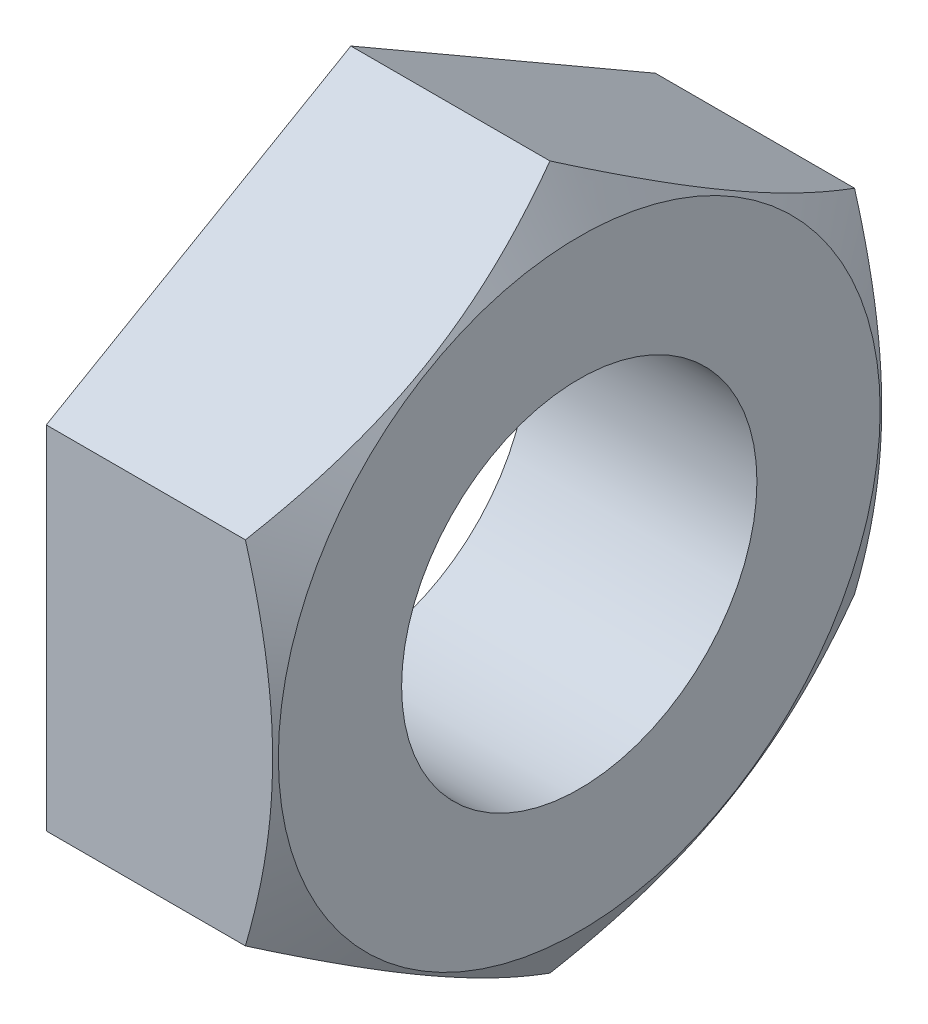
ISO-10303-21;
HEADER;
FILE_DESCRIPTION(('STEP AP214'),'2;1');
FILE_NAME('part.step','',(''),(''),'','','');
FILE_SCHEMA(('AUTOMOTIVE_DESIGN { 1 0 10303 214 1 1 1 1 }'));
ENDSEC;
DATA;
#1=APPLICATION_CONTEXT('core data for automotive mechanical design processes');
#2=APPLICATION_PROTOCOL_DEFINITION('international standard','automotive_design',2000,#1);
#3=PRODUCT_CONTEXT('',#1,'mechanical');
#4=PRODUCT('Part','Part','',(#3));
#5=PRODUCT_RELATED_PRODUCT_CATEGORY('part','',(#4));
#6=PRODUCT_DEFINITION_FORMATION('','',#4);
#7=PRODUCT_DEFINITION_CONTEXT('part definition',#1,'design');
#8=PRODUCT_DEFINITION('design','',#6,#7);
#9=PRODUCT_DEFINITION_SHAPE('','',#8);
#10=(LENGTH_UNIT() NAMED_UNIT(*) SI_UNIT(.MILLI.,.METRE.));
#11=(NAMED_UNIT(*) PLANE_ANGLE_UNIT() SI_UNIT($,.RADIAN.));
#12=(NAMED_UNIT(*) SI_UNIT($,.STERADIAN.) SOLID_ANGLE_UNIT());
#13=UNCERTAINTY_MEASURE_WITH_UNIT(LENGTH_MEASURE(1.E-05),#10,'distance_accuracy_value','');
#14=(GEOMETRIC_REPRESENTATION_CONTEXT(3) GLOBAL_UNCERTAINTY_ASSIGNED_CONTEXT((#13)) GLOBAL_UNIT_ASSIGNED_CONTEXT((#10,
#11,#12)) REPRESENTATION_CONTEXT('',''));
#15=CARTESIAN_POINT('',(0.,0.,0.));
#16=DIRECTION('',(0.,0.,1.));
#17=DIRECTION('',(1.,0.,0.));
#18=AXIS2_PLACEMENT_3D('',#15,#16,#17);
#19=CARTESIAN_POINT('',(-9.,-6.92820323027551,-12.));
#20=DIRECTION('',(0.,0.,-1.));
#21=DIRECTION('',(0.,1.,0.));
#22=AXIS2_PLACEMENT_3D('',#19,#20,#21);
#23=PLANE('',#22);
#24=DIRECTION('',(1.,0.,0.));
#25=VECTOR('',#24,1.);
#26=CARTESIAN_POINT('',(-9.,6.92820323027551,-12.));
#27=LINE('',#26,#25);
#28=CARTESIAN_POINT('',(-9.,6.92820323027551,-12.));
#29=VERTEX_POINT('',#28);
#30=CARTESIAN_POINT('',(-1.15470053837924,6.92820323027551,-12.));
#31=VERTEX_POINT('',#30);
#32=EDGE_CURVE('E59',#29,#31,#27,.T.);
#33=ORIENTED_EDGE('',*,*,#32,.T.);
#34=CARTESIAN_POINT('',(-5.81966745390241,-18.3631195855686,-12.));
#35=CARTESIAN_POINT('',(-5.69237757621555,-18.0997401495386,-12.));
#36=CARTESIAN_POINT('',(-5.56574740463883,-17.8360420387689,-12.));
#37=CARTESIAN_POINT('',(-5.31395792704549,-17.3079411381533,-12.));
#38=CARTESIAN_POINT('',(-5.18879863722962,-17.0435383405851,-12.));
#39=CARTESIAN_POINT('',(-4.81571792806158,-16.2490943195264,-12.));
#40=CARTESIAN_POINT('',(-4.57023525873295,-15.7179032739185,-12.));
#41=CARTESIAN_POINT('',(-4.08595326380888,-14.6488010492418,-12.));
#42=CARTESIAN_POINT('',(-3.84720033209812,-14.1108688018003,-12.));
#43=CARTESIAN_POINT('',(-3.37996196723393,-13.0305792749806,-12.));
#44=CARTESIAN_POINT('',(-3.15147599832778,-12.4882222282474,-12.));
#45=CARTESIAN_POINT('',(-2.70481813282584,-11.3915413509144,-12.));
#46=CARTESIAN_POINT('',(-2.48680572253249,-10.8371522220728,-12.));
#47=CARTESIAN_POINT('',(-2.06788356954227,-9.72182698885641,-12.));
#48=CARTESIAN_POINT('',(-1.86697572914692,-9.16089016414125,-12.));
#49=CARTESIAN_POINT('',(-1.48767214896286,-8.03275157901352,-12.));
#50=CARTESIAN_POINT('',(-1.30922844594757,-7.4655660782369,-12.));
#51=CARTESIAN_POINT('',(-0.980647074321334,-6.32307745633625,-12.));
#52=CARTESIAN_POINT('',(-0.830500451699194,-5.74777696517202,-12.));
#53=CARTESIAN_POINT('',(-0.632004807019301,-4.8786298153939,-12.));
#54=CARTESIAN_POINT('',(-0.570283070894997,-4.58781711018969,-12.));
#55=CARTESIAN_POINT('',(-0.45672382751947,-4.00425850431653,-12.));
#56=CARTESIAN_POINT('',(-0.404886097623505,-3.71151264734702,-12.));
#57=CARTESIAN_POINT('',(-0.31201366941091,-3.12427959978236,-12.));
#58=CARTESIAN_POINT('',(-0.270979838220181,-2.82979227135417,-12.));
#59=CARTESIAN_POINT('',(-0.200542370627931,-2.23943103023774,-12.));
#60=CARTESIAN_POINT('',(-0.171138316036012,-1.9435571677945,-12.));
#61=CARTESIAN_POINT('',(-0.124748745725872,-1.35270954181552,-12.));
#62=CARTESIAN_POINT('',(-0.107686043287743,-1.05774187837439,-12.));
#63=CARTESIAN_POINT('',(-0.0860696022904411,-0.467350046155865,-12.));
#64=CARTESIAN_POINT('',(-0.0815156750989407,-0.171925884329677,-12.));
#65=CARTESIAN_POINT('',(-0.0850247181724462,0.418766165473985,-12.));
#66=CARTESIAN_POINT('',(-0.0930841579198294,0.714034074048225,-12.));
#67=CARTESIAN_POINT('',(-0.121619895083556,1.30397300940907,-12.));
#68=CARTESIAN_POINT('',(-0.14209684299284,1.59864400411482,-12.));
#69=CARTESIAN_POINT('',(-0.206362412146135,2.31298785582646,-12.));
#70=CARTESIAN_POINT('',(-0.256380612112157,2.73211116517899,-12.));
#71=CARTESIAN_POINT('',(-0.378750715302984,3.56706669405872,-12.));
#72=CARTESIAN_POINT('',(-0.451105941827843,3.98289841441537,-12.));
#73=CARTESIAN_POINT('',(-0.698047122504304,5.22618543778535,-12.));
#74=CARTESIAN_POINT('',(-0.902343771156113,6.0478074452462,-12.));
#75=CARTESIAN_POINT('',(-1.2545209473328,7.27679428835951,-12.));
#76=CARTESIAN_POINT('',(-1.3812548665443,7.69058270888653,-12.));
#77=CARTESIAN_POINT('',(-1.64733426417434,8.51416189127863,-12.));
#78=CARTESIAN_POINT('',(-1.78668087936439,8.92395228911067,-12.));
#79=CARTESIAN_POINT('',(-2.07501837520971,9.73749237700048,-12.));
#80=CARTESIAN_POINT('',(-2.22395039369037,10.1412631059238,-12.));
#81=CARTESIAN_POINT('',(-2.45378461391822,10.7443775966691,-12.));
#82=CARTESIAN_POINT('',(-2.53145558493734,10.9449597953764,-12.));
#83=CARTESIAN_POINT('',(-2.6887687336811,11.3453454303414,-12.));
#84=CARTESIAN_POINT('',(-2.76841087218592,11.5451488820022,-12.));
#85=CARTESIAN_POINT('',(-2.84894960236299,11.7445900202455,-12.));
#86=B_SPLINE_CURVE_WITH_KNOTS('',3,(#34,#35,#36,#37,#38,#39,#40,#41,#42,#43,#44,#45,#46,#47,#48,
#49,#50,#51,#52,#53,#54,#55,#56,#57,#58,#59,#60,#61,#62,#63,#64,#65,#66,#67,#68,#69,#70,#71,#72,
#73,#74,#75,#76,#77,#78,#79,#80,#81,#82,#83,#84,#85),.UNSPECIFIED.,.F.,.F.,(4,2,2,2,2,2,2,2,2,2,
2,2,2,2,2,2,2,2,2,2,2,2,2,2,2,4),(0.,0.877576182545852,1.75516202193278,3.51061974583466,
5.27614334322914,7.04157470447039,8.82850506844475,10.6156339087223,12.3988798875154,
14.1815606450176,15.0732909953771,15.9650012564601,16.8567830648188,17.7485328030428,
18.6346558599026,19.5207655539535,20.4066272677118,21.2925353914719,22.5581082199817,
23.8238694310792,26.360270538873,27.6584529181763,28.9567524182772,30.2477253471907,
30.8930022847599,31.5382663937259),.UNSPECIFIED.);
#87=CARTESIAN_POINT('',(-1.15470053837924,-6.92820323027552,-12.));
#88=VERTEX_POINT('',#87);
#89=EDGE_CURVE('E72',#31,#88,#86,.F.);
#90=ORIENTED_EDGE('',*,*,#89,.T.);
#91=DIRECTION('',(1.,0.,0.));
#92=VECTOR('',#91,1.);
#93=CARTESIAN_POINT('',(-9.,-6.92820323027551,-12.));
#94=LINE('',#93,#92);
#95=CARTESIAN_POINT('',(-9.,-6.92820323027551,-12.));
#96=VERTEX_POINT('',#95);
#97=EDGE_CURVE('E13',#96,#88,#94,.T.);
#98=ORIENTED_EDGE('',*,*,#97,.F.);
#99=DIRECTION('',(0.,1.,0.));
#100=VECTOR('',#99,1.);
#101=CARTESIAN_POINT('',(-9.,-6.92820323027551,-12.));
#102=LINE('',#101,#100);
#103=EDGE_CURVE('E148',#96,#29,#102,.T.);
#104=ORIENTED_EDGE('',*,*,#103,.T.);
#105=EDGE_LOOP('',(#33,#90,#98,#104));
#106=FACE_BOUND('',#105,.T.);
#107=ADVANCED_FACE('F55',(#106),#23,.T.);
#108=CARTESIAN_POINT('',(-9.,-13.856406460551,0.));
#109=DIRECTION('',(0.,-0.866025403784439,-0.5));
#110=DIRECTION('',(0.,0.5,-0.866025403784439));
#111=AXIS2_PLACEMENT_3D('',#108,#109,#110);
#112=PLANE('',#111);
#113=ORIENTED_EDGE('',*,*,#97,.T.);
#114=CARTESIAN_POINT('',(-1.15476720587923,-6.92808776022168,-12.0002));
#115=CARTESIAN_POINT('',(-1.06685340084061,-7.0803845601132,-11.7364142047577));
#116=CARTESIAN_POINT('',(-0.982929766211422,-7.23324920067831,-11.4716448806182));
#117=CARTESIAN_POINT('',(-0.824169987527598,-7.5402043401145,-10.9399829834703));
#118=CARTESIAN_POINT('',(-0.74933683232834,-7.69429522451415,-10.6730897427069));
#119=CARTESIAN_POINT('',(-0.539921308508911,-8.15905073005028,-9.86810959402099));
#120=CARTESIAN_POINT('',(-0.42080700537761,-8.47155003173405,-9.3268449261749));
#121=CARTESIAN_POINT('',(-0.281134829657905,-8.93919090681138,-8.51686717084501));
#122=CARTESIAN_POINT('',(-0.241347565695205,-9.09293539869504,-8.25057389951863));
#123=CARTESIAN_POINT('',(-0.174627137871852,-9.40113622968842,-7.71675440130317));
#124=CARTESIAN_POINT('',(-0.147694221422537,-9.55559258244174,-7.44922815078263));
#125=CARTESIAN_POINT('',(-0.107372360571687,-9.86476279544467,-6.91372963367466));
#126=CARTESIAN_POINT('',(-0.0939673215370797,-10.0194761298182,-6.64575827793128));
#127=CARTESIAN_POINT('',(-0.080986862411929,-10.3290461538973,-6.10956726772597));
#128=CARTESIAN_POINT('',(-0.081411015017496,-10.4839028390257,-5.84134762119197));
#129=CARTESIAN_POINT('',(-0.0951237879975342,-10.7734076259435,-5.3399106212159));
#130=CARTESIAN_POINT('',(-0.106739751233292,-10.908076374328,-5.10665750682225));
#131=CARTESIAN_POINT('',(-0.14021177752714,-11.1771041340893,-4.64068775826924));
#132=CARTESIAN_POINT('',(-0.16206856492098,-11.3114631228811,-4.40797116322824));
#133=CARTESIAN_POINT('',(-0.215641185197671,-11.5797983456356,-3.94320092395706));
#134=CARTESIAN_POINT('',(-0.247365161147685,-11.7137741708857,-3.71114798763801));
#135=CARTESIAN_POINT('',(-0.320115544325202,-11.9810977118116,-3.24813003269503));
#136=CARTESIAN_POINT('',(-0.361142583837959,-12.1144453841659,-3.01716508910647));
#137=CARTESIAN_POINT('',(-0.499215421936564,-12.5192297269844,-2.31605804123634));
#138=CARTESIAN_POINT('',(-0.610028656994086,-12.789494193517,-1.84794625372148));
#139=CARTESIAN_POINT('',(-0.861529535592641,-13.3259930983136,-0.918702892408585));
#140=CARTESIAN_POINT('',(-1.00215811131414,-13.5922344058351,-0.457559420707853));
#141=CARTESIAN_POINT('',(-1.15476720587923,-13.8565219306049,0.000199999999991714));
#142=B_SPLINE_CURVE_WITH_KNOTS('',3,(#114,#115,#116,#117,#118,#119,#120,#121,#122,#123,#124,
#125,#126,#127,#128,#129,#130,#131,#132,#133,#134,#135,#136,#137,#138,#139,#140,#141),
.UNSPECIFIED.,.F.,.F.,(4,2,2,2,2,2,2,2,2,2,2,2,2,4),(0.,0.951004872251247,1.90232158356438,
3.80900466161368,4.7389455141357,5.66890426477609,6.59775529889865,7.5265776327693,
8.33514643820578,9.14377244252749,9.95306755799765,10.7624176939264,12.4167102786892,
14.0677556316691),.UNSPECIFIED.);
#143=CARTESIAN_POINT('',(-1.15470053837924,-13.856406460551,0.));
#144=VERTEX_POINT('',#143);
#145=EDGE_CURVE('E161',#88,#144,#142,.T.);
#146=ORIENTED_EDGE('',*,*,#145,.T.);
#147=DIRECTION('',(1.,0.,0.));
#148=VECTOR('',#147,1.);
#149=CARTESIAN_POINT('',(-9.,-13.856406460551,0.));
#150=LINE('',#149,#148);
#151=CARTESIAN_POINT('',(-9.,-13.856406460551,0.));
#152=VERTEX_POINT('',#151);
#153=EDGE_CURVE('E64',#152,#144,#150,.T.);
#154=ORIENTED_EDGE('',*,*,#153,.F.);
#155=DIRECTION('',(0.,0.5,-0.866025403784439));
#156=VECTOR('',#155,1.);
#157=CARTESIAN_POINT('',(-9.,-13.856406460551,0.));
#158=LINE('',#157,#156);
#159=EDGE_CURVE('E136',#152,#96,#158,.T.);
#160=ORIENTED_EDGE('',*,*,#159,.T.);
#161=EDGE_LOOP('',(#113,#146,#154,#160));
#162=FACE_BOUND('',#161,.T.);
#163=ADVANCED_FACE('F198',(#162),#112,.T.);
#164=CARTESIAN_POINT('',(-9.,-6.92820323027551,12.));
#165=DIRECTION('',(0.,-0.866025403784439,0.5));
#166=DIRECTION('',(0.,-0.5,-0.866025403784439));
#167=AXIS2_PLACEMENT_3D('',#164,#165,#166);
#168=PLANE('',#167);
#169=ORIENTED_EDGE('',*,*,#153,.T.);
#170=CARTESIAN_POINT('',(-1.15476720587923,-13.8565219306049,-0.000200000000008534));
#171=CARTESIAN_POINT('',(-1.06685340084061,-13.7042251307133,0.263585795242254));
#172=CARTESIAN_POINT('',(-0.98292976621142,-13.5513604901482,0.528355119381791));
#173=CARTESIAN_POINT('',(-0.824169987527596,-13.244405350712,1.06001701652965));
#174=CARTESIAN_POINT('',(-0.749336832328338,-13.0903144663124,1.32691025729306));
#175=CARTESIAN_POINT('',(-0.539921308508909,-12.6255589607763,2.131890405979));
#176=CARTESIAN_POINT('',(-0.420807005377607,-12.3130596590925,2.67315507382509));
#177=CARTESIAN_POINT('',(-0.281134829657901,-11.8454187840152,3.48313282915499));
#178=CARTESIAN_POINT('',(-0.241347565695201,-11.6916742921315,3.74942610048136));
#179=CARTESIAN_POINT('',(-0.174627137871848,-11.3834734611381,4.28324559869683));
#180=CARTESIAN_POINT('',(-0.147694221422533,-11.2290171083848,4.55077184921737));
#181=CARTESIAN_POINT('',(-0.107372360571683,-10.9198468953819,5.08627036632534));
#182=CARTESIAN_POINT('',(-0.0939673215370758,-10.7651335610083,5.35424172206872));
#183=CARTESIAN_POINT('',(-0.080986862411925,-10.4555635369292,5.89043273227403));
#184=CARTESIAN_POINT('',(-0.0814110150174919,-10.3007068518009,6.15865237880803));
#185=CARTESIAN_POINT('',(-0.09512378799753,-10.0112020648831,6.66008937878409));
#186=CARTESIAN_POINT('',(-0.106739751233288,-9.87653331649856,6.89334249317775));
#187=CARTESIAN_POINT('',(-0.140211777527136,-9.60750555673726,7.35931224173076));
#188=CARTESIAN_POINT('',(-0.162068564920977,-9.47314656794544,7.59202883677176));
#189=CARTESIAN_POINT('',(-0.215641185197667,-9.2048113451909,8.05679907604294));
#190=CARTESIAN_POINT('',(-0.247365161147681,-9.07083551994085,8.28885201236199));
#191=CARTESIAN_POINT('',(-0.320115544325197,-8.80351197901489,8.75186996730497));
#192=CARTESIAN_POINT('',(-0.361142583837955,-8.67016430666067,8.98283491089354));
#193=CARTESIAN_POINT('',(-0.499215421936561,-8.26537996384211,9.68394195876366));
#194=CARTESIAN_POINT('',(-0.610028656994082,-7.99511549730956,10.1520537462785));
#195=CARTESIAN_POINT('',(-0.861529535592636,-7.45861659251289,11.0812971075914));
#196=CARTESIAN_POINT('',(-1.00215811131413,-7.19237528499143,11.5424405792922));
#197=CARTESIAN_POINT('',(-1.15476720587923,-6.92808776022167,12.0002));
#198=B_SPLINE_CURVE_WITH_KNOTS('',3,(#170,#171,#172,#173,#174,#175,#176,#177,#178,#179,#180,
#181,#182,#183,#184,#185,#186,#187,#188,#189,#190,#191,#192,#193,#194,#195,#196,#197),
.UNSPECIFIED.,.F.,.F.,(4,2,2,2,2,2,2,2,2,2,2,2,2,4),(0.,0.951004872251245,1.90232158356437,
3.80900466161368,4.7389455141357,5.66890426477609,6.59775529889865,7.5265776327693,
8.33514643820578,9.14377244252749,9.95306755799765,10.7624176939264,12.4167102786892,
14.0677556316691),.UNSPECIFIED.);
#199=CARTESIAN_POINT('',(-1.15470053837924,-6.92820323027552,12.));
#200=VERTEX_POINT('',#199);
#201=EDGE_CURVE('E124',#144,#200,#198,.T.);
#202=ORIENTED_EDGE('',*,*,#201,.T.);
#203=DIRECTION('',(1.,0.,0.));
#204=VECTOR('',#203,1.);
#205=CARTESIAN_POINT('',(-9.,-6.92820323027551,12.));
#206=LINE('',#205,#204);
#207=CARTESIAN_POINT('',(-9.,-6.92820323027551,12.));
#208=VERTEX_POINT('',#207);
#209=EDGE_CURVE('E123',#208,#200,#206,.T.);
#210=ORIENTED_EDGE('',*,*,#209,.F.);
#211=DIRECTION('',(0.,-0.5,-0.866025403784439));
#212=VECTOR('',#211,1.);
#213=CARTESIAN_POINT('',(-9.,-6.92820323027551,12.));
#214=LINE('',#213,#212);
#215=EDGE_CURVE('E139',#208,#152,#214,.T.);
#216=ORIENTED_EDGE('',*,*,#215,.T.);
#217=EDGE_LOOP('',(#169,#202,#210,#216));
#218=FACE_BOUND('',#217,.T.);
#219=ADVANCED_FACE('F195',(#218),#168,.T.);
#220=CARTESIAN_POINT('',(-9.,6.92820323027551,12.));
#221=DIRECTION('',(0.,0.,1.));
#222=DIRECTION('',(0.,-1.,0.));
#223=AXIS2_PLACEMENT_3D('',#220,#221,#222);
#224=PLANE('',#223);
#225=ORIENTED_EDGE('',*,*,#209,.T.);
#226=CARTESIAN_POINT('',(-5.81966745390241,-18.3631195855686,12.));
#227=CARTESIAN_POINT('',(-5.69237757621555,-18.0997401495386,12.));
#228=CARTESIAN_POINT('',(-5.56574740463882,-17.8360420387689,12.));
#229=CARTESIAN_POINT('',(-5.31395792704549,-17.3079411381533,12.));
#230=CARTESIAN_POINT('',(-5.18879863722961,-17.0435383405851,12.));
#231=CARTESIAN_POINT('',(-4.81571792806157,-16.2490943195263,12.));
#232=CARTESIAN_POINT('',(-4.57023525873295,-15.7179032739185,12.));
#233=CARTESIAN_POINT('',(-4.08595326380887,-14.6488010492418,12.));
#234=CARTESIAN_POINT('',(-3.84720033209811,-14.1108688018002,12.));
#235=CARTESIAN_POINT('',(-3.37996196723392,-13.0305792749806,12.));
#236=CARTESIAN_POINT('',(-3.15147599832776,-12.4882222282474,12.));
#237=CARTESIAN_POINT('',(-2.70481813282583,-11.3915413509144,12.));
#238=CARTESIAN_POINT('',(-2.48680572253248,-10.8371522220728,12.));
#239=CARTESIAN_POINT('',(-2.06788356954227,-9.72182698885639,12.));
#240=CARTESIAN_POINT('',(-1.86697572914691,-9.16089016414124,12.));
#241=CARTESIAN_POINT('',(-1.48767214896285,-8.03275157901351,12.));
#242=CARTESIAN_POINT('',(-1.30922844594756,-7.46556607823689,12.));
#243=CARTESIAN_POINT('',(-0.98064707432133,-6.32307745633625,12.));
#244=CARTESIAN_POINT('',(-0.830500451699192,-5.74777696517201,12.));
#245=CARTESIAN_POINT('',(-0.632004807019298,-4.8786298153939,12.));
#246=CARTESIAN_POINT('',(-0.570283070894993,-4.58781711018968,12.));
#247=CARTESIAN_POINT('',(-0.456723827519466,-4.00425850431652,12.));
#248=CARTESIAN_POINT('',(-0.404886097623502,-3.71151264734702,12.));
#249=CARTESIAN_POINT('',(-0.312013669410908,-3.12427959978235,12.));
#250=CARTESIAN_POINT('',(-0.270979838220178,-2.82979227135417,12.));
#251=CARTESIAN_POINT('',(-0.200542370627929,-2.23943103023774,12.));
#252=CARTESIAN_POINT('',(-0.171138316036011,-1.9435571677945,12.));
#253=CARTESIAN_POINT('',(-0.124748745725871,-1.35270954181551,12.));
#254=CARTESIAN_POINT('',(-0.107686043287741,-1.05774187837439,12.));
#255=CARTESIAN_POINT('',(-0.0860696022904394,-0.467350046155859,12.));
#256=CARTESIAN_POINT('',(-0.0815156750989399,-0.171925884329671,12.));
#257=CARTESIAN_POINT('',(-0.0850247181724466,0.418766165473991,12.));
#258=CARTESIAN_POINT('',(-0.0930841579198302,0.714034074048231,12.));
#259=CARTESIAN_POINT('',(-0.121619895083558,1.30397300940907,12.));
#260=CARTESIAN_POINT('',(-0.142096842992841,1.59864400411482,12.));
#261=CARTESIAN_POINT('',(-0.206362412146137,2.31298785582646,12.));
#262=CARTESIAN_POINT('',(-0.256380612112159,2.73211116517899,12.));
#263=CARTESIAN_POINT('',(-0.378750715302986,3.56706669405872,12.));
#264=CARTESIAN_POINT('',(-0.451105941827845,3.98289841441538,12.));
#265=CARTESIAN_POINT('',(-0.698047122504307,5.22618543778536,12.));
#266=CARTESIAN_POINT('',(-0.902343771156117,6.04780744524621,12.));
#267=CARTESIAN_POINT('',(-1.2545209473328,7.27679428835951,12.));
#268=CARTESIAN_POINT('',(-1.3812548665443,7.69058270888653,12.));
#269=CARTESIAN_POINT('',(-1.64733426417435,8.51416189127863,12.));
#270=CARTESIAN_POINT('',(-1.7866808793644,8.92395228911068,12.));
#271=CARTESIAN_POINT('',(-2.07501837520971,9.73749237700048,12.));
#272=CARTESIAN_POINT('',(-2.22395039369038,10.1412631059238,12.));
#273=CARTESIAN_POINT('',(-2.45378461391823,10.7443775966691,12.));
#274=CARTESIAN_POINT('',(-2.53145558493735,10.9449597953764,12.));
#275=CARTESIAN_POINT('',(-2.6887687336811,11.3453454303414,12.));
#276=CARTESIAN_POINT('',(-2.76841087218593,11.5451488820022,12.));
#277=CARTESIAN_POINT('',(-2.848949602363,11.7445900202456,12.));
#278=B_SPLINE_CURVE_WITH_KNOTS('',3,(#226,#227,#228,#229,#230,#231,#232,#233,#234,#235,#236,
#237,#238,#239,#240,#241,#242,#243,#244,#245,#246,#247,#248,#249,#250,#251,#252,#253,#254,#255,
#256,#257,#258,#259,#260,#261,#262,#263,#264,#265,#266,#267,#268,#269,#270,#271,#272,#273,#274,
#275,#276,#277),.UNSPECIFIED.,.F.,.F.,(4,2,2,2,2,2,2,2,2,2,2,2,2,2,2,2,2,2,2,2,2,2,2,2,2,4),(0.,
0.877576182545848,1.75516202193278,3.51061974583466,5.27614334322914,7.04157470447039,
8.82850506844476,10.6156339087223,12.3988798875154,14.1815606450176,15.0732909953771,
15.9650012564601,16.8567830648188,17.7485328030428,18.6346558599026,19.5207655539535,
20.4066272677118,21.2925353914719,22.5581082199817,23.8238694310792,26.360270538873,
27.6584529181763,28.9567524182772,30.2477253471907,30.8930022847599,31.5382663937259),.UNSPECIFIED.);
#279=CARTESIAN_POINT('',(-1.15470053837924,6.92820323027551,12.));
#280=VERTEX_POINT('',#279);
#281=EDGE_CURVE('E110',#200,#280,#278,.T.);
#282=ORIENTED_EDGE('',*,*,#281,.T.);
#283=DIRECTION('',(1.,0.,0.));
#284=VECTOR('',#283,1.);
#285=CARTESIAN_POINT('',(-9.,6.92820323027551,12.));
#286=LINE('',#285,#284);
#287=CARTESIAN_POINT('',(-9.,6.92820323027551,12.));
#288=VERTEX_POINT('',#287);
#289=EDGE_CURVE('E121',#288,#280,#286,.T.);
#290=ORIENTED_EDGE('',*,*,#289,.F.);
#291=DIRECTION('',(0.,-1.,0.));
#292=VECTOR('',#291,1.);
#293=CARTESIAN_POINT('',(-9.,6.92820323027551,12.));
#294=LINE('',#293,#292);
#295=EDGE_CURVE('E142',#288,#208,#294,.T.);
#296=ORIENTED_EDGE('',*,*,#295,.T.);
#297=EDGE_LOOP('',(#225,#282,#290,#296));
#298=FACE_BOUND('',#297,.T.);
#299=ADVANCED_FACE('F119',(#298),#224,.T.);
#300=CARTESIAN_POINT('',(-9.,13.856406460551,0.));
#301=DIRECTION('',(0.,0.866025403784439,0.5));
#302=DIRECTION('',(0.,-0.5,0.866025403784439));
#303=AXIS2_PLACEMENT_3D('',#300,#301,#302);
#304=PLANE('',#303);
#305=ORIENTED_EDGE('',*,*,#289,.T.);
#306=CARTESIAN_POINT('',(-1.15476720587923,6.92808776022168,12.0002));
#307=CARTESIAN_POINT('',(-1.06685340084062,7.08038456011319,11.7364142047577));
#308=CARTESIAN_POINT('',(-0.982929766211423,7.23324920067831,11.4716448806182));
#309=CARTESIAN_POINT('',(-0.824169987527598,7.5402043401145,10.9399829834703));
#310=CARTESIAN_POINT('',(-0.74933683232834,7.69429522451414,10.6730897427069));
#311=CARTESIAN_POINT('',(-0.539921308508909,8.15905073005028,9.868109594021));
#312=CARTESIAN_POINT('',(-0.420807005377609,8.47155003173405,9.32684492617491));
#313=CARTESIAN_POINT('',(-0.281134829657904,8.93919090681137,8.51686717084501));
#314=CARTESIAN_POINT('',(-0.241347565695205,9.09293539869504,8.25057389951863));
#315=CARTESIAN_POINT('',(-0.174627137871851,9.40113622968841,7.71675440130317));
#316=CARTESIAN_POINT('',(-0.147694221422536,9.55559258244174,7.44922815078262));
#317=CARTESIAN_POINT('',(-0.107372360571686,9.86476279544467,6.91372963367465));
#318=CARTESIAN_POINT('',(-0.0939673215370776,10.0194761298182,6.64575827793128));
#319=CARTESIAN_POINT('',(-0.0809868624119263,10.3290461538973,6.10956726772597));
#320=CARTESIAN_POINT('',(-0.0814110150174935,10.4839028390257,5.84134762119197));
#321=CARTESIAN_POINT('',(-0.0951237879975323,10.7734076259435,5.3399106212159));
#322=CARTESIAN_POINT('',(-0.106739751233291,10.908076374328,5.10665750682225));
#323=CARTESIAN_POINT('',(-0.140211777527139,11.1771041340893,4.64068775826924));
#324=CARTESIAN_POINT('',(-0.162068564920979,11.3114631228811,4.40797116322823));
#325=CARTESIAN_POINT('',(-0.21564118519767,11.5797983456356,3.94320092395706));
#326=CARTESIAN_POINT('',(-0.247365161147684,11.7137741708857,3.711147987638));
#327=CARTESIAN_POINT('',(-0.320115544325201,11.9810977118116,3.24813003269502));
#328=CARTESIAN_POINT('',(-0.361142583837958,12.1144453841659,3.01716508910646));
#329=CARTESIAN_POINT('',(-0.499215421936563,12.5192297269844,2.31605804123633));
#330=CARTESIAN_POINT('',(-0.610028656994085,12.789494193517,1.84794625372147));
#331=CARTESIAN_POINT('',(-0.86152953559264,13.3259930983136,0.918702892408577));
#332=CARTESIAN_POINT('',(-1.00215811131414,13.5922344058351,0.457559420707844));
#333=CARTESIAN_POINT('',(-1.15476720587923,13.8565219306049,-0.000200000000000816));
#334=B_SPLINE_CURVE_WITH_KNOTS('',3,(#306,#307,#308,#309,#310,#311,#312,#313,#314,#315,#316,
#317,#318,#319,#320,#321,#322,#323,#324,#325,#326,#327,#328,#329,#330,#331,#332,#333),
.UNSPECIFIED.,.F.,.F.,(4,2,2,2,2,2,2,2,2,2,2,2,2,4),(0.,0.951004872251242,1.90232158356437,
3.80900466161368,4.7389455141357,5.66890426477609,6.59775529889865,7.5265776327693,
8.33514643820578,9.14377244252749,9.95306755799765,10.7624176939264,12.4167102786892,
14.0677556316691),.UNSPECIFIED.);
#335=CARTESIAN_POINT('',(-1.15470053837924,13.856406460551,0.));
#336=VERTEX_POINT('',#335);
#337=EDGE_CURVE('E107',#280,#336,#334,.T.);
#338=ORIENTED_EDGE('',*,*,#337,.T.);
#339=DIRECTION('',(1.,0.,0.));
#340=VECTOR('',#339,1.);
#341=CARTESIAN_POINT('',(-9.,13.856406460551,0.));
#342=LINE('',#341,#340);
#343=CARTESIAN_POINT('',(-9.,13.856406460551,0.));
#344=VERTEX_POINT('',#343);
#345=EDGE_CURVE('E130',#344,#336,#342,.T.);
#346=ORIENTED_EDGE('',*,*,#345,.F.);
#347=DIRECTION('',(0.,-0.5,0.866025403784439));
#348=VECTOR('',#347,1.);
#349=CARTESIAN_POINT('',(-9.,13.856406460551,0.));
#350=LINE('',#349,#348);
#351=EDGE_CURVE('E129',#344,#288,#350,.T.);
#352=ORIENTED_EDGE('',*,*,#351,.T.);
#353=EDGE_LOOP('',(#305,#338,#346,#352));
#354=FACE_BOUND('',#353,.T.);
#355=ADVANCED_FACE('F127',(#354),#304,.T.);
#356=CARTESIAN_POINT('',(-9.,6.92820323027551,-12.));
#357=DIRECTION('',(0.,0.866025403784439,-0.5));
#358=DIRECTION('',(0.,0.5,0.866025403784439));
#359=AXIS2_PLACEMENT_3D('',#356,#357,#358);
#360=PLANE('',#359);
#361=ORIENTED_EDGE('',*,*,#345,.T.);
#362=CARTESIAN_POINT('',(-1.15476720587923,13.8565219306049,0.000199999999999812));
#363=CARTESIAN_POINT('',(-1.06685340084061,13.7042251307133,-0.263585795242262));
#364=CARTESIAN_POINT('',(-0.982929766211421,13.5513604901482,-0.5283551193818));
#365=CARTESIAN_POINT('',(-0.824169987527596,13.244405350712,-1.06001701652966));
#366=CARTESIAN_POINT('',(-0.749336832328338,13.0903144663124,-1.32691025729307));
#367=CARTESIAN_POINT('',(-0.539921308508909,12.6255589607763,-2.13189040597901));
#368=CARTESIAN_POINT('',(-0.420807005377608,12.3130596590925,-2.6731550738251));
#369=CARTESIAN_POINT('',(-0.281134829657903,11.8454187840152,-3.483132829155));
#370=CARTESIAN_POINT('',(-0.241347565695203,11.6916742921315,-3.74942610048137));
#371=CARTESIAN_POINT('',(-0.174627137871849,11.3834734611381,-4.28324559869684));
#372=CARTESIAN_POINT('',(-0.147694221422534,11.2290171083848,-4.55077184921738));
#373=CARTESIAN_POINT('',(-0.107372360571684,10.9198468953819,-5.08627036632535));
#374=CARTESIAN_POINT('',(-0.0939673215370762,10.7651335610083,-5.35424172206873));
#375=CARTESIAN_POINT('',(-0.0809868624119258,10.4555635369292,-5.89043273227404));
#376=CARTESIAN_POINT('',(-0.0814110150174935,10.3007068518009,-6.15865237880804));
#377=CARTESIAN_POINT('',(-0.0951237879975324,10.0112020648831,-6.6600893787841));
#378=CARTESIAN_POINT('',(-0.106739751233291,9.87653331649856,-6.89334249317775));
#379=CARTESIAN_POINT('',(-0.140211777527138,9.60750555673726,-7.35931224173077));
#380=CARTESIAN_POINT('',(-0.162068564920978,9.47314656794544,-7.59202883677177));
#381=CARTESIAN_POINT('',(-0.215641185197669,9.2048113451909,-8.05679907604294));
#382=CARTESIAN_POINT('',(-0.247365161147683,9.07083551994085,-8.288852012362));
#383=CARTESIAN_POINT('',(-0.3201155443252,8.80351197901489,-8.75186996730498));
#384=CARTESIAN_POINT('',(-0.361142583837957,8.67016430666067,-8.98283491089354));
#385=CARTESIAN_POINT('',(-0.499215421936562,8.26537996384211,-9.68394195876367));
#386=CARTESIAN_POINT('',(-0.610028656994084,7.99511549730956,-10.1520537462785));
#387=CARTESIAN_POINT('',(-0.861529535592639,7.45861659251289,-11.0812971075914));
#388=CARTESIAN_POINT('',(-1.00215811131414,7.19237528499144,-11.5424405792922));
#389=CARTESIAN_POINT('',(-1.15476720587923,6.92808776022168,-12.0002));
#390=B_SPLINE_CURVE_WITH_KNOTS('',3,(#362,#363,#364,#365,#366,#367,#368,#369,#370,#371,#372,
#373,#374,#375,#376,#377,#378,#379,#380,#381,#382,#383,#384,#385,#386,#387,#388,#389),
.UNSPECIFIED.,.F.,.F.,(4,2,2,2,2,2,2,2,2,2,2,2,2,4),(0.,0.951004872251246,1.90232158356438,
3.80900466161368,4.7389455141357,5.66890426477609,6.59775529889865,7.5265776327693,
8.33514643820578,9.14377244252749,9.95306755799765,10.7624176939264,12.4167102786892,
14.0677556316691),.UNSPECIFIED.);
#391=EDGE_CURVE('E112',#336,#31,#390,.T.);
#392=ORIENTED_EDGE('',*,*,#391,.T.);
#393=ORIENTED_EDGE('',*,*,#32,.F.);
#394=DIRECTION('',(0.,0.5,0.866025403784439));
#395=VECTOR('',#394,1.);
#396=CARTESIAN_POINT('',(-9.,6.92820323027551,-12.));
#397=LINE('',#396,#395);
#398=EDGE_CURVE('E145',#29,#344,#397,.T.);
#399=ORIENTED_EDGE('',*,*,#398,.T.);
#400=EDGE_LOOP('',(#361,#392,#393,#399));
#401=FACE_BOUND('',#400,.T.);
#402=ADVANCED_FACE('F206',(#401),#360,.T.);
#403=CARTESIAN_POINT('',(0.,0.,0.));
#404=DIRECTION('',(1.,0.,0.));
#405=DIRECTION('',(0.,0.,-1.));
#406=AXIS2_PLACEMENT_3D('',#403,#404,#405);
#407=PLANE('',#406);
#408=CARTESIAN_POINT('',(0.,0.,0.));
#409=DIRECTION('',(1.,0.,0.));
#410=DIRECTION('',(0.,0.,-1.));
#411=AXIS2_PLACEMENT_3D('',#408,#409,#410);
#412=CIRCLE('',#411,7.);
#413=CARTESIAN_POINT('',(0.,0.,-7.));
#414=VERTEX_POINT('',#413);
#415=EDGE_CURVE('E153',#414,#414,#412,.T.);
#416=ORIENTED_EDGE('',*,*,#415,.F.);
#417=EDGE_LOOP('',(#416));
#418=FACE_BOUND('',#417,.T.);
#419=CARTESIAN_POINT('',(0.,0.,0.));
#420=DIRECTION('',(-1.,0.,0.));
#421=DIRECTION('',(0.,0.,1.));
#422=AXIS2_PLACEMENT_3D('',#419,#420,#421);
#423=CIRCLE('',#422,11.856406460551);
#424=CARTESIAN_POINT('',(0.,0.,11.856406460551));
#425=VERTEX_POINT('',#424);
#426=EDGE_CURVE('E239',#425,#425,#423,.T.);
#427=ORIENTED_EDGE('',*,*,#426,.F.);
#428=EDGE_LOOP('',(#427));
#429=FACE_BOUND('',#428,.T.);
#430=ADVANCED_FACE('F209',(#418,#429),#407,.T.);
#431=CARTESIAN_POINT('',(-9.,0.,0.));
#432=DIRECTION('',(1.,0.,0.));
#433=DIRECTION('',(0.,0.,-1.));
#434=AXIS2_PLACEMENT_3D('',#431,#432,#433);
#435=PLANE('',#434);
#436=CARTESIAN_POINT('',(-9.,0.,0.));
#437=DIRECTION('',(1.,0.,0.));
#438=DIRECTION('',(0.,0.,-1.));
#439=AXIS2_PLACEMENT_3D('',#436,#437,#438);
#440=CIRCLE('',#439,7.);
#441=CARTESIAN_POINT('',(-9.,0.,-7.));
#442=VERTEX_POINT('',#441);
#443=EDGE_CURVE('E150',#442,#442,#440,.T.);
#444=ORIENTED_EDGE('',*,*,#443,.T.);
#445=EDGE_LOOP('',(#444));
#446=FACE_BOUND('',#445,.T.);
#447=ORIENTED_EDGE('',*,*,#103,.F.);
#448=ORIENTED_EDGE('',*,*,#159,.F.);
#449=ORIENTED_EDGE('',*,*,#215,.F.);
#450=ORIENTED_EDGE('',*,*,#295,.F.);
#451=ORIENTED_EDGE('',*,*,#351,.F.);
#452=ORIENTED_EDGE('',*,*,#398,.F.);
#453=EDGE_LOOP('',(#447,#448,#449,#450,#451,#452));
#454=FACE_BOUND('',#453,.T.);
#455=ADVANCED_FACE('F214',(#446,#454),#435,.F.);
#456=CARTESIAN_POINT('',(0.,0.,0.));
#457=DIRECTION('',(1.,0.,0.));
#458=DIRECTION('',(0.,0.,-1.));
#459=AXIS2_PLACEMENT_3D('',#456,#457,#458);
#460=CYLINDRICAL_SURFACE('',#459,7.);
#461=ORIENTED_EDGE('',*,*,#443,.F.);
#462=EDGE_LOOP('',(#461));
#463=FACE_BOUND('',#462,.T.);
#464=ORIENTED_EDGE('',*,*,#415,.T.);
#465=EDGE_LOOP('',(#464));
#466=FACE_BOUND('',#465,.T.);
#467=ADVANCED_FACE('F170',(#463,#466),#460,.F.);
#468=CARTESIAN_POINT('',(-1.15470053837924,0.,0.));
#469=DIRECTION('',(-1.,0.,0.));
#470=DIRECTION('',(0.,0.,1.));
#471=AXIS2_PLACEMENT_3D('',#468,#469,#470);
#472=CONICAL_SURFACE('',#471,13.856406460551,1.0471975511966);
#473=ORIENTED_EDGE('',*,*,#426,.T.);
#474=EDGE_LOOP('',(#473));
#475=FACE_BOUND('',#474,.T.);
#476=ORIENTED_EDGE('',*,*,#391,.F.);
#477=ORIENTED_EDGE('',*,*,#337,.F.);
#478=ORIENTED_EDGE('',*,*,#281,.F.);
#479=ORIENTED_EDGE('',*,*,#201,.F.);
#480=ORIENTED_EDGE('',*,*,#145,.F.);
#481=ORIENTED_EDGE('',*,*,#89,.F.);
#482=EDGE_LOOP('',(#476,#477,#478,#479,#480,#481));
#483=FACE_BOUND('',#482,.T.);
#484=ADVANCED_FACE('F109',(#475,#483),#472,.T.);
#485=CLOSED_SHELL('',(#107,#163,#219,#299,#355,#402,#430,#455,#467,#484));
#486=MANIFOLD_SOLID_BREP('B2',#485);
#487=ADVANCED_BREP_SHAPE_REPRESENTATION('',(#18,#486),#14);
#488=SHAPE_DEFINITION_REPRESENTATION(#9,#487);
ENDSEC;
END-ISO-10303-21;
